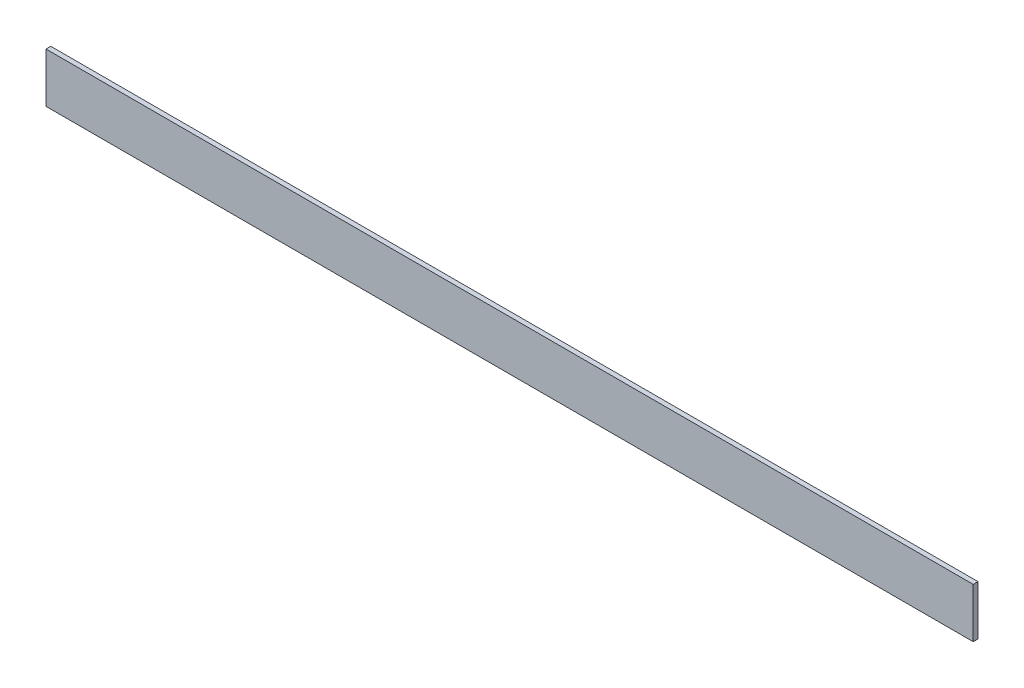
ISO-10303-21;
HEADER;
FILE_DESCRIPTION(('STEP AP214'),'2;1');
FILE_NAME('part.step','',(''),(''),'','','');
FILE_SCHEMA(('AUTOMOTIVE_DESIGN { 1 0 10303 214 1 1 1 1 }'));
ENDSEC;
DATA;
#1=APPLICATION_CONTEXT('core data for automotive mechanical design processes');
#2=APPLICATION_PROTOCOL_DEFINITION('international standard','automotive_design',2000,#1);
#3=PRODUCT_CONTEXT('',#1,'mechanical');
#4=PRODUCT('Part','Part','',(#3));
#5=PRODUCT_RELATED_PRODUCT_CATEGORY('part','',(#4));
#6=PRODUCT_DEFINITION_FORMATION('','',#4);
#7=PRODUCT_DEFINITION_CONTEXT('part definition',#1,'design');
#8=PRODUCT_DEFINITION('design','',#6,#7);
#9=PRODUCT_DEFINITION_SHAPE('','',#8);
#10=(LENGTH_UNIT() NAMED_UNIT(*) SI_UNIT(.MILLI.,.METRE.));
#11=(NAMED_UNIT(*) PLANE_ANGLE_UNIT() SI_UNIT($,.RADIAN.));
#12=(NAMED_UNIT(*) SI_UNIT($,.STERADIAN.) SOLID_ANGLE_UNIT());
#13=UNCERTAINTY_MEASURE_WITH_UNIT(LENGTH_MEASURE(1.E-05),#10,'distance_accuracy_value','');
#14=(GEOMETRIC_REPRESENTATION_CONTEXT(3) GLOBAL_UNCERTAINTY_ASSIGNED_CONTEXT((#13)) GLOBAL_UNIT_ASSIGNED_CONTEXT((#10,
#11,#12)) REPRESENTATION_CONTEXT('',''));
#15=CARTESIAN_POINT('',(0.,0.,0.));
#16=DIRECTION('',(0.,0.,1.));
#17=DIRECTION('',(1.,0.,0.));
#18=AXIS2_PLACEMENT_3D('',#15,#16,#17);
#19=CARTESIAN_POINT('',(0.,0.,3.175));
#20=DIRECTION('',(1.,0.,0.));
#21=DIRECTION('',(0.,0.,-1.));
#22=AXIS2_PLACEMENT_3D('',#19,#20,#21);
#23=PLANE('',#22);
#24=DIRECTION('',(0.,-1.,0.));
#25=VECTOR('',#24,1.);
#26=CARTESIAN_POINT('',(0.,0.,0.));
#27=LINE('',#26,#25);
#28=CARTESIAN_POINT('',(0.,33.,0.));
#29=VERTEX_POINT('',#28);
#30=CARTESIAN_POINT('',(0.,0.,0.));
#31=VERTEX_POINT('',#30);
#32=EDGE_CURVE('E96',#29,#31,#27,.T.);
#33=ORIENTED_EDGE('',*,*,#32,.T.);
#34=DIRECTION('',(0.,0.,-1.));
#35=VECTOR('',#34,1.);
#36=CARTESIAN_POINT('',(0.,0.,3.175));
#37=LINE('',#36,#35);
#38=CARTESIAN_POINT('',(0.,0.,3.175));
#39=VERTEX_POINT('',#38);
#40=EDGE_CURVE('E11',#39,#31,#37,.T.);
#41=ORIENTED_EDGE('',*,*,#40,.F.);
#42=DIRECTION('',(0.,-1.,0.));
#43=VECTOR('',#42,1.);
#44=CARTESIAN_POINT('',(0.,0.,3.175));
#45=LINE('',#44,#43);
#46=CARTESIAN_POINT('',(0.,33.,3.175));
#47=VERTEX_POINT('',#46);
#48=EDGE_CURVE('E84',#47,#39,#45,.T.);
#49=ORIENTED_EDGE('',*,*,#48,.F.);
#50=DIRECTION('',(0.,0.,-1.));
#51=VECTOR('',#50,1.);
#52=CARTESIAN_POINT('',(0.,33.,3.175));
#53=LINE('',#52,#51);
#54=EDGE_CURVE('E92',#47,#29,#53,.T.);
#55=ORIENTED_EDGE('',*,*,#54,.T.);
#56=EDGE_LOOP('',(#33,#41,#49,#55));
#57=FACE_BOUND('',#56,.T.);
#58=ADVANCED_FACE('F33',(#57),#23,.F.);
#59=CARTESIAN_POINT('',(0.,0.,3.175));
#60=DIRECTION('',(0.,1.,0.));
#61=DIRECTION('',(0.,0.,1.));
#62=AXIS2_PLACEMENT_3D('',#59,#60,#61);
#63=PLANE('',#62);
#64=DIRECTION('',(1.,0.,0.));
#65=VECTOR('',#64,1.);
#66=CARTESIAN_POINT('',(0.,0.,0.));
#67=LINE('',#66,#65);
#68=CARTESIAN_POINT('',(615.95,0.,0.));
#69=VERTEX_POINT('',#68);
#70=EDGE_CURVE('E88',#31,#69,#67,.T.);
#71=ORIENTED_EDGE('',*,*,#70,.T.);
#72=DIRECTION('',(0.,0.,-1.));
#73=VECTOR('',#72,1.);
#74=CARTESIAN_POINT('',(615.95,0.,3.175));
#75=LINE('',#74,#73);
#76=CARTESIAN_POINT('',(615.95,0.,3.175));
#77=VERTEX_POINT('',#76);
#78=EDGE_CURVE('E41',#77,#69,#75,.T.);
#79=ORIENTED_EDGE('',*,*,#78,.F.);
#80=DIRECTION('',(1.,0.,0.));
#81=VECTOR('',#80,1.);
#82=CARTESIAN_POINT('',(0.,0.,3.175));
#83=LINE('',#82,#81);
#84=EDGE_CURVE('E79',#39,#77,#83,.T.);
#85=ORIENTED_EDGE('',*,*,#84,.F.);
#86=ORIENTED_EDGE('',*,*,#40,.T.);
#87=EDGE_LOOP('',(#71,#79,#85,#86));
#88=FACE_BOUND('',#87,.T.);
#89=ADVANCED_FACE('F87',(#88),#63,.F.);
#90=CARTESIAN_POINT('',(615.95,0.,3.175));
#91=DIRECTION('',(-1.,0.,0.));
#92=DIRECTION('',(0.,0.,1.));
#93=AXIS2_PLACEMENT_3D('',#90,#91,#92);
#94=PLANE('',#93);
#95=DIRECTION('',(0.,1.,0.));
#96=VECTOR('',#95,1.);
#97=CARTESIAN_POINT('',(615.95,0.,0.));
#98=LINE('',#97,#96);
#99=CARTESIAN_POINT('',(615.95,33.,0.));
#100=VERTEX_POINT('',#99);
#101=EDGE_CURVE('E66',#69,#100,#98,.T.);
#102=ORIENTED_EDGE('',*,*,#101,.T.);
#103=DIRECTION('',(0.,0.,-1.));
#104=VECTOR('',#103,1.);
#105=CARTESIAN_POINT('',(615.95,33.,3.175));
#106=LINE('',#105,#104);
#107=CARTESIAN_POINT('',(615.95,33.,3.175));
#108=VERTEX_POINT('',#107);
#109=EDGE_CURVE('E89',#108,#100,#106,.T.);
#110=ORIENTED_EDGE('',*,*,#109,.F.);
#111=DIRECTION('',(0.,1.,0.));
#112=VECTOR('',#111,1.);
#113=CARTESIAN_POINT('',(615.95,0.,3.175));
#114=LINE('',#113,#112);
#115=EDGE_CURVE('E82',#77,#108,#114,.T.);
#116=ORIENTED_EDGE('',*,*,#115,.F.);
#117=ORIENTED_EDGE('',*,*,#78,.T.);
#118=EDGE_LOOP('',(#102,#110,#116,#117));
#119=FACE_BOUND('',#118,.T.);
#120=ADVANCED_FACE('F90',(#119),#94,.F.);
#121=CARTESIAN_POINT('',(0.,33.,3.175));
#122=DIRECTION('',(0.,-1.,0.));
#123=DIRECTION('',(0.,0.,-1.));
#124=AXIS2_PLACEMENT_3D('',#121,#122,#123);
#125=PLANE('',#124);
#126=DIRECTION('',(-1.,0.,0.));
#127=VECTOR('',#126,1.);
#128=CARTESIAN_POINT('',(0.,33.,0.));
#129=LINE('',#128,#127);
#130=EDGE_CURVE('E72',#100,#29,#129,.T.);
#131=ORIENTED_EDGE('',*,*,#130,.T.);
#132=ORIENTED_EDGE('',*,*,#54,.F.);
#133=DIRECTION('',(-1.,0.,0.));
#134=VECTOR('',#133,1.);
#135=CARTESIAN_POINT('',(0.,33.,3.175));
#136=LINE('',#135,#134);
#137=EDGE_CURVE('E49',#108,#47,#136,.T.);
#138=ORIENTED_EDGE('',*,*,#137,.F.);
#139=ORIENTED_EDGE('',*,*,#109,.T.);
#140=EDGE_LOOP('',(#131,#132,#138,#139));
#141=FACE_BOUND('',#140,.T.);
#142=ADVANCED_FACE('F103',(#141),#125,.F.);
#143=CARTESIAN_POINT('',(0.,0.,3.175));
#144=DIRECTION('',(0.,0.,-1.));
#145=DIRECTION('',(-1.,0.,0.));
#146=AXIS2_PLACEMENT_3D('',#143,#144,#145);
#147=PLANE('',#146);
#148=ORIENTED_EDGE('',*,*,#48,.T.);
#149=ORIENTED_EDGE('',*,*,#84,.T.);
#150=ORIENTED_EDGE('',*,*,#115,.T.);
#151=ORIENTED_EDGE('',*,*,#137,.T.);
#152=EDGE_LOOP('',(#148,#149,#150,#151));
#153=FACE_BOUND('',#152,.T.);
#154=ADVANCED_FACE('F80',(#153),#147,.F.);
#155=CARTESIAN_POINT('',(0.,0.,0.));
#156=DIRECTION('',(0.,0.,-1.));
#157=DIRECTION('',(-1.,0.,0.));
#158=AXIS2_PLACEMENT_3D('',#155,#156,#157);
#159=PLANE('',#158);
#160=ORIENTED_EDGE('',*,*,#32,.F.);
#161=ORIENTED_EDGE('',*,*,#130,.F.);
#162=ORIENTED_EDGE('',*,*,#101,.F.);
#163=ORIENTED_EDGE('',*,*,#70,.F.);
#164=EDGE_LOOP('',(#160,#161,#162,#163));
#165=FACE_BOUND('',#164,.T.);
#166=ADVANCED_FACE('F106',(#165),#159,.T.);
#167=CLOSED_SHELL('',(#58,#89,#120,#142,#154,#166));
#168=MANIFOLD_SOLID_BREP('B2',#167);
#169=ADVANCED_BREP_SHAPE_REPRESENTATION('',(#18,#168),#14);
#170=SHAPE_DEFINITION_REPRESENTATION(#9,#169);
ENDSEC;
END-ISO-10303-21;
